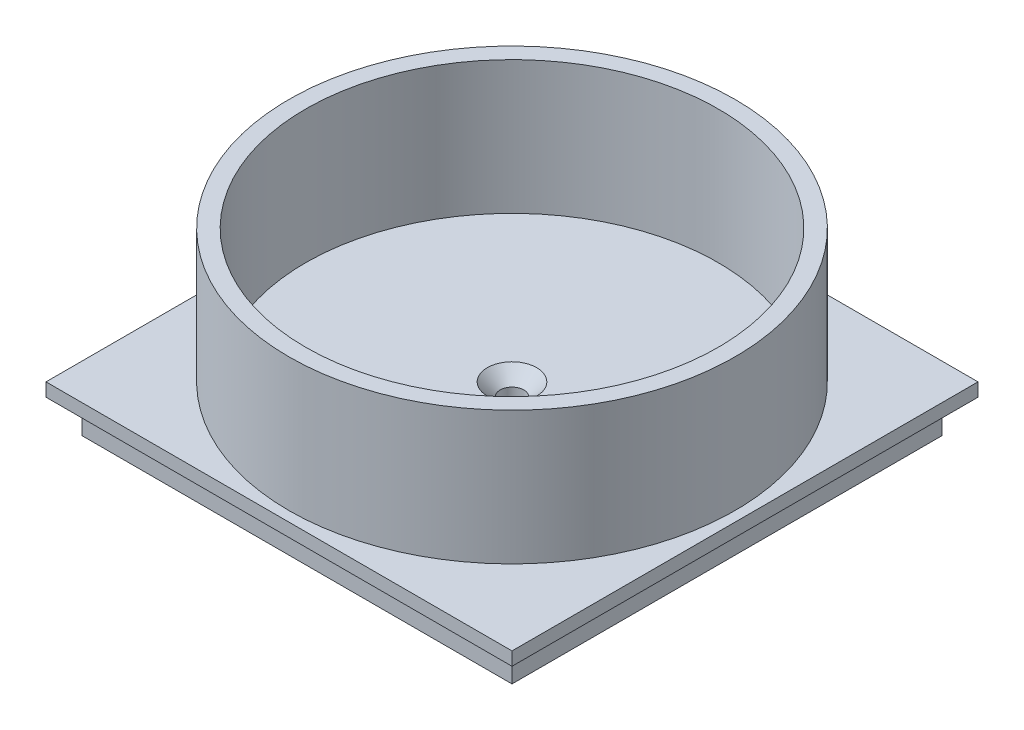
ISO-10303-21;
HEADER;
FILE_DESCRIPTION(('STEP AP214'),'2;1');
FILE_NAME('part.step','',(''),(''),'','','');
FILE_SCHEMA(('AUTOMOTIVE_DESIGN { 1 0 10303 214 1 1 1 1 }'));
ENDSEC;
DATA;
#1=APPLICATION_CONTEXT('core data for automotive mechanical design processes');
#2=APPLICATION_PROTOCOL_DEFINITION('international standard','automotive_design',2000,#1);
#3=PRODUCT_CONTEXT('',#1,'mechanical');
#4=PRODUCT('Part','Part','',(#3));
#5=PRODUCT_RELATED_PRODUCT_CATEGORY('part','',(#4));
#6=PRODUCT_DEFINITION_FORMATION('','',#4);
#7=PRODUCT_DEFINITION_CONTEXT('part definition',#1,'design');
#8=PRODUCT_DEFINITION('design','',#6,#7);
#9=PRODUCT_DEFINITION_SHAPE('','',#8);
#10=(LENGTH_UNIT() NAMED_UNIT(*) SI_UNIT(.MILLI.,.METRE.));
#11=(NAMED_UNIT(*) PLANE_ANGLE_UNIT() SI_UNIT($,.RADIAN.));
#12=(NAMED_UNIT(*) SI_UNIT($,.STERADIAN.) SOLID_ANGLE_UNIT());
#13=UNCERTAINTY_MEASURE_WITH_UNIT(LENGTH_MEASURE(1.E-05),#10,'distance_accuracy_value','');
#14=(GEOMETRIC_REPRESENTATION_CONTEXT(3) GLOBAL_UNCERTAINTY_ASSIGNED_CONTEXT((#13)) GLOBAL_UNIT_ASSIGNED_CONTEXT((#10,
#11,#12)) REPRESENTATION_CONTEXT('',''));
#15=CARTESIAN_POINT('',(0.,0.,0.));
#16=DIRECTION('',(0.,0.,1.));
#17=DIRECTION('',(1.,0.,0.));
#18=AXIS2_PLACEMENT_3D('',#15,#16,#17);
#19=CARTESIAN_POINT('',(0.,8.89,0.));
#20=DIRECTION('',(0.,1.,0.));
#21=DIRECTION('',(0.,0.,1.));
#22=AXIS2_PLACEMENT_3D('',#19,#20,#21);
#23=PLANE('',#22);
#24=CARTESIAN_POINT('',(41.021,8.89,-41.021));
#25=DIRECTION('',(0.,1.,0.));
#26=DIRECTION('',(0.,0.,1.));
#27=AXIS2_PLACEMENT_3D('',#24,#25,#26);
#28=CIRCLE('',#27,4.7);
#29=CARTESIAN_POINT('',(41.021,8.89,-36.321));
#30=VERTEX_POINT('',#29);
#31=EDGE_CURVE('E393',#30,#30,#28,.T.);
#32=ORIENTED_EDGE('',*,*,#31,.F.);
#33=EDGE_LOOP('',(#32));
#34=FACE_BOUND('',#33,.T.);
#35=CARTESIAN_POINT('',(41.021,8.89,-41.021));
#36=DIRECTION('',(0.,1.,0.));
#37=DIRECTION('',(0.,0.,1.));
#38=AXIS2_PLACEMENT_3D('',#35,#36,#37);
#39=CIRCLE('',#38,39.37);
#40=CARTESIAN_POINT('',(41.021,8.89,-1.65100000000001));
#41=VERTEX_POINT('',#40);
#42=EDGE_CURVE('E11',#41,#41,#39,.F.);
#43=ORIENTED_EDGE('',*,*,#42,.F.);
#44=EDGE_LOOP('',(#43));
#45=FACE_BOUND('',#44,.T.);
#46=ADVANCED_FACE('F38',(#34,#45),#23,.T.);
#47=CARTESIAN_POINT('',(0.,6.35,0.));
#48=DIRECTION('',(1.,0.,0.));
#49=DIRECTION('',(0.,0.,-1.));
#50=AXIS2_PLACEMENT_3D('',#47,#48,#49);
#51=PLANE('',#50);
#52=DIRECTION('',(0.,0.,1.));
#53=VECTOR('',#52,1.);
#54=CARTESIAN_POINT('',(0.,0.,0.));
#55=LINE('',#54,#53);
#56=CARTESIAN_POINT('',(0.,0.,-82.042));
#57=VERTEX_POINT('',#56);
#58=CARTESIAN_POINT('',(0.,0.,0.));
#59=VERTEX_POINT('',#58);
#60=EDGE_CURVE('E138',#57,#59,#55,.T.);
#61=ORIENTED_EDGE('',*,*,#60,.T.);
#62=DIRECTION('',(0.,-1.,0.));
#63=VECTOR('',#62,1.);
#64=CARTESIAN_POINT('',(0.,6.35,0.));
#65=LINE('',#64,#63);
#66=CARTESIAN_POINT('',(0.,6.35,0.));
#67=VERTEX_POINT('',#66);
#68=EDGE_CURVE('E47',#67,#59,#65,.T.);
#69=ORIENTED_EDGE('',*,*,#68,.F.);
#70=DIRECTION('',(0.,0.,1.));
#71=VECTOR('',#70,1.);
#72=CARTESIAN_POINT('',(0.,6.35,0.));
#73=LINE('',#72,#71);
#74=CARTESIAN_POINT('',(0.,6.35,-82.042));
#75=VERTEX_POINT('',#74);
#76=EDGE_CURVE('E147',#75,#67,#73,.T.);
#77=ORIENTED_EDGE('',*,*,#76,.F.);
#78=DIRECTION('',(0.,-1.,0.));
#79=VECTOR('',#78,1.);
#80=CARTESIAN_POINT('',(0.,6.35,-82.042));
#81=LINE('',#80,#79);
#82=EDGE_CURVE('E156',#75,#57,#81,.T.);
#83=ORIENTED_EDGE('',*,*,#82,.T.);
#84=EDGE_LOOP('',(#61,#69,#77,#83));
#85=FACE_BOUND('',#84,.T.);
#86=ADVANCED_FACE('F40',(#85),#51,.F.);
#87=CARTESIAN_POINT('',(0.,6.35,0.));
#88=DIRECTION('',(0.,0.,-1.));
#89=DIRECTION('',(-1.,0.,0.));
#90=AXIS2_PLACEMENT_3D('',#87,#88,#89);
#91=PLANE('',#90);
#92=DIRECTION('',(1.,0.,0.));
#93=VECTOR('',#92,1.);
#94=CARTESIAN_POINT('',(0.,0.,0.));
#95=LINE('',#94,#93);
#96=CARTESIAN_POINT('',(82.042,0.,0.));
#97=VERTEX_POINT('',#96);
#98=EDGE_CURVE('E141',#59,#97,#95,.T.);
#99=ORIENTED_EDGE('',*,*,#98,.T.);
#100=DIRECTION('',(0.,-1.,0.));
#101=VECTOR('',#100,1.);
#102=CARTESIAN_POINT('',(82.042,6.35,0.));
#103=LINE('',#102,#101);
#104=CARTESIAN_POINT('',(82.042,6.35,0.));
#105=VERTEX_POINT('',#104);
#106=EDGE_CURVE('E163',#105,#97,#103,.T.);
#107=ORIENTED_EDGE('',*,*,#106,.F.);
#108=DIRECTION('',(1.,0.,0.));
#109=VECTOR('',#108,1.);
#110=CARTESIAN_POINT('',(0.,6.35,0.));
#111=LINE('',#110,#109);
#112=EDGE_CURVE('E82',#67,#105,#111,.T.);
#113=ORIENTED_EDGE('',*,*,#112,.F.);
#114=ORIENTED_EDGE('',*,*,#68,.T.);
#115=EDGE_LOOP('',(#99,#107,#113,#114));
#116=FACE_BOUND('',#115,.T.);
#117=ADVANCED_FACE('F164',(#116),#91,.F.);
#118=CARTESIAN_POINT('',(82.042,6.35,0.));
#119=DIRECTION('',(-1.,0.,0.));
#120=DIRECTION('',(0.,0.,1.));
#121=AXIS2_PLACEMENT_3D('',#118,#119,#120);
#122=PLANE('',#121);
#123=DIRECTION('',(0.,0.,-1.));
#124=VECTOR('',#123,1.);
#125=CARTESIAN_POINT('',(82.042,0.,0.));
#126=LINE('',#125,#124);
#127=CARTESIAN_POINT('',(82.042,0.,-82.042));
#128=VERTEX_POINT('',#127);
#129=EDGE_CURVE('E71',#97,#128,#126,.T.);
#130=ORIENTED_EDGE('',*,*,#129,.T.);
#131=DIRECTION('',(0.,-1.,0.));
#132=VECTOR('',#131,1.);
#133=CARTESIAN_POINT('',(82.042,6.35,-82.042));
#134=LINE('',#133,#132);
#135=CARTESIAN_POINT('',(82.042,6.35,-82.042));
#136=VERTEX_POINT('',#135);
#137=EDGE_CURVE('E55',#136,#128,#134,.T.);
#138=ORIENTED_EDGE('',*,*,#137,.F.);
#139=DIRECTION('',(0.,0.,-1.));
#140=VECTOR('',#139,1.);
#141=CARTESIAN_POINT('',(82.042,6.35,0.));
#142=LINE('',#141,#140);
#143=EDGE_CURVE('E151',#105,#136,#142,.T.);
#144=ORIENTED_EDGE('',*,*,#143,.F.);
#145=ORIENTED_EDGE('',*,*,#106,.T.);
#146=EDGE_LOOP('',(#130,#138,#144,#145));
#147=FACE_BOUND('',#146,.T.);
#148=ADVANCED_FACE('F180',(#147),#122,.F.);
#149=CARTESIAN_POINT('',(0.,6.35,-82.042));
#150=DIRECTION('',(0.,0.,1.));
#151=DIRECTION('',(1.,0.,0.));
#152=AXIS2_PLACEMENT_3D('',#149,#150,#151);
#153=PLANE('',#152);
#154=DIRECTION('',(-1.,0.,0.));
#155=VECTOR('',#154,1.);
#156=CARTESIAN_POINT('',(0.,0.,-82.042));
#157=LINE('',#156,#155);
#158=EDGE_CURVE('E76',#128,#57,#157,.T.);
#159=ORIENTED_EDGE('',*,*,#158,.T.);
#160=ORIENTED_EDGE('',*,*,#82,.F.);
#161=DIRECTION('',(-1.,0.,0.));
#162=VECTOR('',#161,1.);
#163=CARTESIAN_POINT('',(0.,6.35,-82.042));
#164=LINE('',#163,#162);
#165=EDGE_CURVE('E154',#136,#75,#164,.T.);
#166=ORIENTED_EDGE('',*,*,#165,.F.);
#167=ORIENTED_EDGE('',*,*,#137,.T.);
#168=EDGE_LOOP('',(#159,#160,#166,#167));
#169=FACE_BOUND('',#168,.T.);
#170=ADVANCED_FACE('F171',(#169),#153,.F.);
#171=CARTESIAN_POINT('',(0.,0.,0.));
#172=DIRECTION('',(0.,-1.,0.));
#173=DIRECTION('',(0.,0.,-1.));
#174=AXIS2_PLACEMENT_3D('',#171,#172,#173);
#175=PLANE('',#174);
#176=CARTESIAN_POINT('',(41.021,0.,-41.021));
#177=DIRECTION('',(0.,1.,0.));
#178=DIRECTION('',(0.,0.,1.));
#179=AXIS2_PLACEMENT_3D('',#176,#177,#178);
#180=CIRCLE('',#179,2.25);
#181=CARTESIAN_POINT('',(41.021,0.,-38.771));
#182=VERTEX_POINT('',#181);
#183=EDGE_CURVE('E216',#182,#182,#180,.T.);
#184=ORIENTED_EDGE('',*,*,#183,.T.);
#185=EDGE_LOOP('',(#184));
#186=FACE_BOUND('',#185,.T.);
#187=ORIENTED_EDGE('',*,*,#60,.F.);
#188=ORIENTED_EDGE('',*,*,#158,.F.);
#189=ORIENTED_EDGE('',*,*,#129,.F.);
#190=ORIENTED_EDGE('',*,*,#98,.F.);
#191=EDGE_LOOP('',(#187,#188,#189,#190));
#192=FACE_BOUND('',#191,.T.);
#193=ADVANCED_FACE('F168',(#186,#192),#175,.T.);
#194=CARTESIAN_POINT('',(0.,6.35,0.));
#195=DIRECTION('',(0.,1.,0.));
#196=DIRECTION('',(0.,0.,1.));
#197=AXIS2_PLACEMENT_3D('',#194,#195,#196);
#198=PLANE('',#197);
#199=DIRECTION('',(0.,0.,1.));
#200=VECTOR('',#199,1.);
#201=CARTESIAN_POINT('',(-3.429,6.35,-85.471));
#202=LINE('',#201,#200);
#203=CARTESIAN_POINT('',(-3.429,6.35,-85.471));
#204=VERTEX_POINT('',#203);
#205=CARTESIAN_POINT('',(-3.429,6.35,3.42899999999999));
#206=VERTEX_POINT('',#205);
#207=EDGE_CURVE('E137',#204,#206,#202,.T.);
#208=ORIENTED_EDGE('',*,*,#207,.F.);
#209=DIRECTION('',(-1.,0.,0.));
#210=VECTOR('',#209,1.);
#211=CARTESIAN_POINT('',(-3.429,6.35,-85.471));
#212=LINE('',#211,#210);
#213=CARTESIAN_POINT('',(85.471,6.35,-85.471));
#214=VERTEX_POINT('',#213);
#215=EDGE_CURVE('E133',#214,#204,#212,.T.);
#216=ORIENTED_EDGE('',*,*,#215,.F.);
#217=DIRECTION('',(0.,0.,-1.));
#218=VECTOR('',#217,1.);
#219=CARTESIAN_POINT('',(85.471,6.35,-85.471));
#220=LINE('',#219,#218);
#221=CARTESIAN_POINT('',(85.471,6.35,3.42899999999999));
#222=VERTEX_POINT('',#221);
#223=EDGE_CURVE('E229',#222,#214,#220,.T.);
#224=ORIENTED_EDGE('',*,*,#223,.F.);
#225=DIRECTION('',(1.,0.,0.));
#226=VECTOR('',#225,1.);
#227=CARTESIAN_POINT('',(-3.429,6.35,3.42899999999999));
#228=LINE('',#227,#226);
#229=EDGE_CURVE('E227',#206,#222,#228,.T.);
#230=ORIENTED_EDGE('',*,*,#229,.F.);
#231=EDGE_LOOP('',(#208,#216,#224,#230));
#232=FACE_BOUND('',#231,.T.);
#233=ORIENTED_EDGE('',*,*,#165,.T.);
#234=ORIENTED_EDGE('',*,*,#76,.T.);
#235=ORIENTED_EDGE('',*,*,#112,.T.);
#236=ORIENTED_EDGE('',*,*,#143,.T.);
#237=EDGE_LOOP('',(#233,#234,#235,#236));
#238=FACE_BOUND('',#237,.T.);
#239=ADVANCED_FACE('F170',(#232,#238),#198,.F.);
#240=CARTESIAN_POINT('',(-3.429,8.89,-85.471));
#241=DIRECTION('',(1.,0.,0.));
#242=DIRECTION('',(0.,0.,-1.));
#243=AXIS2_PLACEMENT_3D('',#240,#241,#242);
#244=PLANE('',#243);
#245=ORIENTED_EDGE('',*,*,#207,.T.);
#246=DIRECTION('',(0.,-1.,0.));
#247=VECTOR('',#246,1.);
#248=CARTESIAN_POINT('',(-3.429,8.89,3.42899999999999));
#249=LINE('',#248,#247);
#250=CARTESIAN_POINT('',(-3.429,8.89,3.42899999999999));
#251=VERTEX_POINT('',#250);
#252=EDGE_CURVE('E117',#251,#206,#249,.T.);
#253=ORIENTED_EDGE('',*,*,#252,.F.);
#254=DIRECTION('',(0.,0.,1.));
#255=VECTOR('',#254,1.);
#256=CARTESIAN_POINT('',(-3.429,8.89,-85.471));
#257=LINE('',#256,#255);
#258=CARTESIAN_POINT('',(-3.429,8.89,-85.471));
#259=VERTEX_POINT('',#258);
#260=EDGE_CURVE('E124',#259,#251,#257,.T.);
#261=ORIENTED_EDGE('',*,*,#260,.F.);
#262=DIRECTION('',(0.,-1.,0.));
#263=VECTOR('',#262,1.);
#264=CARTESIAN_POINT('',(-3.429,8.89,-85.471));
#265=LINE('',#264,#263);
#266=EDGE_CURVE('E225',#259,#204,#265,.T.);
#267=ORIENTED_EDGE('',*,*,#266,.T.);
#268=EDGE_LOOP('',(#245,#253,#261,#267));
#269=FACE_BOUND('',#268,.T.);
#270=ADVANCED_FACE('F135',(#269),#244,.F.);
#271=CARTESIAN_POINT('',(-3.429,8.89,3.42899999999999));
#272=DIRECTION('',(0.,0.,-1.));
#273=DIRECTION('',(-1.,0.,0.));
#274=AXIS2_PLACEMENT_3D('',#271,#272,#273);
#275=PLANE('',#274);
#276=ORIENTED_EDGE('',*,*,#229,.T.);
#277=DIRECTION('',(0.,-1.,0.));
#278=VECTOR('',#277,1.);
#279=CARTESIAN_POINT('',(85.471,8.89,3.42899999999999));
#280=LINE('',#279,#278);
#281=CARTESIAN_POINT('',(85.471,8.89,3.42899999999999));
#282=VERTEX_POINT('',#281);
#283=EDGE_CURVE('E120',#282,#222,#280,.T.);
#284=ORIENTED_EDGE('',*,*,#283,.F.);
#285=DIRECTION('',(1.,0.,0.));
#286=VECTOR('',#285,1.);
#287=CARTESIAN_POINT('',(-3.429,8.89,3.42899999999999));
#288=LINE('',#287,#286);
#289=EDGE_CURVE('E113',#251,#282,#288,.T.);
#290=ORIENTED_EDGE('',*,*,#289,.F.);
#291=ORIENTED_EDGE('',*,*,#252,.T.);
#292=EDGE_LOOP('',(#276,#284,#290,#291));
#293=FACE_BOUND('',#292,.T.);
#294=ADVANCED_FACE('F115',(#293),#275,.F.);
#295=CARTESIAN_POINT('',(85.471,8.89,-85.471));
#296=DIRECTION('',(-1.,0.,0.));
#297=DIRECTION('',(0.,0.,1.));
#298=AXIS2_PLACEMENT_3D('',#295,#296,#297);
#299=PLANE('',#298);
#300=ORIENTED_EDGE('',*,*,#223,.T.);
#301=DIRECTION('',(0.,-1.,0.));
#302=VECTOR('',#301,1.);
#303=CARTESIAN_POINT('',(85.471,8.89,-85.471));
#304=LINE('',#303,#302);
#305=CARTESIAN_POINT('',(85.471,8.89,-85.471));
#306=VERTEX_POINT('',#305);
#307=EDGE_CURVE('E143',#306,#214,#304,.T.);
#308=ORIENTED_EDGE('',*,*,#307,.F.);
#309=DIRECTION('',(0.,0.,-1.));
#310=VECTOR('',#309,1.);
#311=CARTESIAN_POINT('',(85.471,8.89,-85.471));
#312=LINE('',#311,#310);
#313=EDGE_CURVE('E123',#282,#306,#312,.T.);
#314=ORIENTED_EDGE('',*,*,#313,.F.);
#315=ORIENTED_EDGE('',*,*,#283,.T.);
#316=EDGE_LOOP('',(#300,#308,#314,#315));
#317=FACE_BOUND('',#316,.T.);
#318=ADVANCED_FACE('F205',(#317),#299,.F.);
#319=CARTESIAN_POINT('',(-3.429,8.89,-85.471));
#320=DIRECTION('',(0.,0.,1.));
#321=DIRECTION('',(1.,0.,0.));
#322=AXIS2_PLACEMENT_3D('',#319,#320,#321);
#323=PLANE('',#322);
#324=ORIENTED_EDGE('',*,*,#215,.T.);
#325=ORIENTED_EDGE('',*,*,#266,.F.);
#326=DIRECTION('',(-1.,0.,0.));
#327=VECTOR('',#326,1.);
#328=CARTESIAN_POINT('',(-3.429,8.89,-85.471));
#329=LINE('',#328,#327);
#330=EDGE_CURVE('E129',#306,#259,#329,.T.);
#331=ORIENTED_EDGE('',*,*,#330,.F.);
#332=ORIENTED_EDGE('',*,*,#307,.T.);
#333=EDGE_LOOP('',(#324,#325,#331,#332));
#334=FACE_BOUND('',#333,.T.);
#335=ADVANCED_FACE('F197',(#334),#323,.F.);
#336=CARTESIAN_POINT('',(41.021,8.89,-41.021));
#337=DIRECTION('',(0.,1.,0.));
#338=DIRECTION('',(0.,0.,1.));
#339=AXIS2_PLACEMENT_3D('',#336,#337,#338);
#340=CIRCLE('',#339,42.545);
#341=CARTESIAN_POINT('',(41.021,8.89,1.52400000000002));
#342=VERTEX_POINT('',#341);
#343=EDGE_CURVE('E210',#342,#342,#340,.T.);
#344=ORIENTED_EDGE('',*,*,#343,.F.);
#345=EDGE_LOOP('',(#344));
#346=FACE_BOUND('',#345,.T.);
#347=ORIENTED_EDGE('',*,*,#260,.T.);
#348=ORIENTED_EDGE('',*,*,#289,.T.);
#349=ORIENTED_EDGE('',*,*,#313,.T.);
#350=ORIENTED_EDGE('',*,*,#330,.T.);
#351=EDGE_LOOP('',(#347,#348,#349,#350));
#352=FACE_BOUND('',#351,.T.);
#353=ADVANCED_FACE('F127',(#346,#352),#23,.T.);
#354=CARTESIAN_POINT('',(41.021,0.,-41.021));
#355=DIRECTION('',(0.,1.,0.));
#356=DIRECTION('',(0.,0.,1.));
#357=AXIS2_PLACEMENT_3D('',#354,#355,#356);
#358=CYLINDRICAL_SURFACE('',#357,2.25);
#359=ORIENTED_EDGE('',*,*,#183,.F.);
#360=EDGE_LOOP('',(#359));
#361=FACE_BOUND('',#360,.T.);
#362=CARTESIAN_POINT('',(41.021,6.43999999999999,-41.021));
#363=DIRECTION('',(0.,1.,0.));
#364=DIRECTION('',(0.,0.,1.));
#365=AXIS2_PLACEMENT_3D('',#362,#363,#364);
#366=CIRCLE('',#365,2.24999999999999);
#367=CARTESIAN_POINT('',(41.021,6.43999999999999,-38.771));
#368=VERTEX_POINT('',#367);
#369=EDGE_CURVE('E219',#368,#368,#366,.T.);
#370=ORIENTED_EDGE('',*,*,#369,.T.);
#371=EDGE_LOOP('',(#370));
#372=FACE_BOUND('',#371,.T.);
#373=ADVANCED_FACE('F196',(#361,#372),#358,.F.);
#374=CARTESIAN_POINT('',(41.021,34.29,-41.021));
#375=DIRECTION('',(0.,1.,0.));
#376=DIRECTION('',(0.,0.,1.));
#377=AXIS2_PLACEMENT_3D('',#374,#375,#376);
#378=PLANE('',#377);
#379=CARTESIAN_POINT('',(41.021,34.29,-41.021));
#380=DIRECTION('',(0.,1.,0.));
#381=DIRECTION('',(0.,0.,1.));
#382=AXIS2_PLACEMENT_3D('',#379,#380,#381);
#383=CIRCLE('',#382,42.545);
#384=CARTESIAN_POINT('',(41.021,34.29,1.52400000000002));
#385=VERTEX_POINT('',#384);
#386=EDGE_CURVE('E212',#385,#385,#383,.T.);
#387=ORIENTED_EDGE('',*,*,#386,.T.);
#388=EDGE_LOOP('',(#387));
#389=FACE_BOUND('',#388,.T.);
#390=CARTESIAN_POINT('',(41.021,34.29,-41.021));
#391=DIRECTION('',(0.,1.,0.));
#392=DIRECTION('',(0.,0.,1.));
#393=AXIS2_PLACEMENT_3D('',#390,#391,#392);
#394=CIRCLE('',#393,39.37);
#395=CARTESIAN_POINT('',(41.021,34.29,-1.65100000000001));
#396=VERTEX_POINT('',#395);
#397=EDGE_CURVE('E213',#396,#396,#394,.T.);
#398=ORIENTED_EDGE('',*,*,#397,.F.);
#399=EDGE_LOOP('',(#398));
#400=FACE_BOUND('',#399,.T.);
#401=ADVANCED_FACE('F203',(#389,#400),#378,.T.);
#402=CARTESIAN_POINT('',(41.021,34.29,-41.021));
#403=DIRECTION('',(0.,-1.,0.));
#404=DIRECTION('',(0.,0.,-1.));
#405=AXIS2_PLACEMENT_3D('',#402,#403,#404);
#406=CYLINDRICAL_SURFACE('',#405,42.545);
#407=ORIENTED_EDGE('',*,*,#386,.F.);
#408=EDGE_LOOP('',(#407));
#409=FACE_BOUND('',#408,.T.);
#410=ORIENTED_EDGE('',*,*,#343,.T.);
#411=EDGE_LOOP('',(#410));
#412=FACE_BOUND('',#411,.T.);
#413=ADVANCED_FACE('F288',(#409,#412),#406,.T.);
#414=CARTESIAN_POINT('',(41.021,34.29,-41.021));
#415=DIRECTION('',(0.,-1.,0.));
#416=DIRECTION('',(0.,0.,-1.));
#417=AXIS2_PLACEMENT_3D('',#414,#415,#416);
#418=CYLINDRICAL_SURFACE('',#417,39.37);
#419=ORIENTED_EDGE('',*,*,#397,.T.);
#420=EDGE_LOOP('',(#419));
#421=FACE_BOUND('',#420,.T.);
#422=ORIENTED_EDGE('',*,*,#42,.T.);
#423=EDGE_LOOP('',(#422));
#424=FACE_BOUND('',#423,.T.);
#425=ADVANCED_FACE('F299',(#421,#424),#418,.F.);
#426=CARTESIAN_POINT('',(41.021,8.89,-41.021));
#427=DIRECTION('',(0.,1.,0.));
#428=DIRECTION('',(0.,0.,1.));
#429=AXIS2_PLACEMENT_3D('',#426,#427,#428);
#430=CONICAL_SURFACE('',#429,4.7,0.785398163397449);
#431=ORIENTED_EDGE('',*,*,#369,.F.);
#432=EDGE_LOOP('',(#431));
#433=FACE_BOUND('',#432,.T.);
#434=ORIENTED_EDGE('',*,*,#31,.T.);
#435=EDGE_LOOP('',(#434));
#436=FACE_BOUND('',#435,.T.);
#437=ADVANCED_FACE('F309',(#433,#436),#430,.F.);
#438=CLOSED_SHELL('',(#46,#86,#117,#148,#170,#193,#239,#270,#294,#318,#335,#353,#373,#401,#413,
#425,#437));
#439=MANIFOLD_SOLID_BREP('B2',#438);
#440=ADVANCED_BREP_SHAPE_REPRESENTATION('',(#18,#439),#14);
#441=SHAPE_DEFINITION_REPRESENTATION(#9,#440);
ENDSEC;
END-ISO-10303-21;
